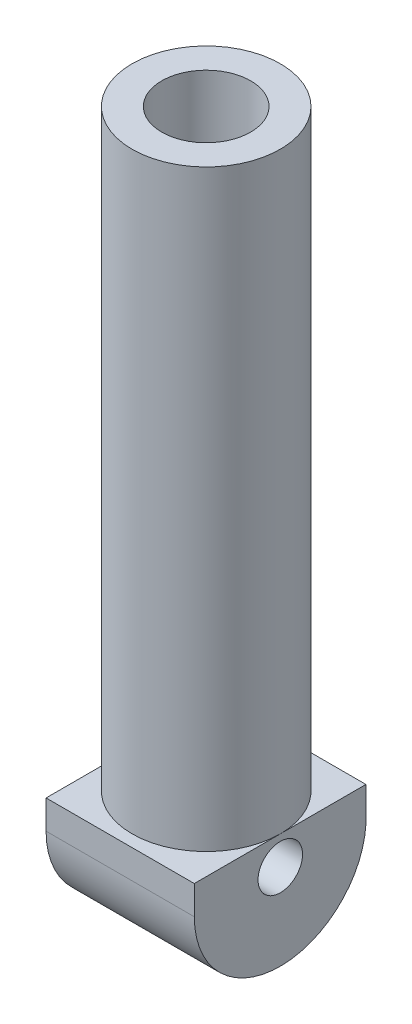
ISO-10303-21;
HEADER;
FILE_DESCRIPTION(('STEP AP214'),'2;1');
FILE_NAME('part.step','',(''),(''),'','','');
FILE_SCHEMA(('AUTOMOTIVE_DESIGN { 1 0 10303 214 1 1 1 1 }'));
ENDSEC;
DATA;
#1=APPLICATION_CONTEXT('core data for automotive mechanical design processes');
#2=APPLICATION_PROTOCOL_DEFINITION('international standard','automotive_design',2000,#1);
#3=PRODUCT_CONTEXT('',#1,'mechanical');
#4=PRODUCT('Part','Part','',(#3));
#5=PRODUCT_RELATED_PRODUCT_CATEGORY('part','',(#4));
#6=PRODUCT_DEFINITION_FORMATION('','',#4);
#7=PRODUCT_DEFINITION_CONTEXT('part definition',#1,'design');
#8=PRODUCT_DEFINITION('design','',#6,#7);
#9=PRODUCT_DEFINITION_SHAPE('','',#8);
#10=(LENGTH_UNIT() NAMED_UNIT(*) SI_UNIT(.MILLI.,.METRE.));
#11=(NAMED_UNIT(*) PLANE_ANGLE_UNIT() SI_UNIT($,.RADIAN.));
#12=(NAMED_UNIT(*) SI_UNIT($,.STERADIAN.) SOLID_ANGLE_UNIT());
#13=UNCERTAINTY_MEASURE_WITH_UNIT(LENGTH_MEASURE(1.E-05),#10,'distance_accuracy_value','');
#14=(GEOMETRIC_REPRESENTATION_CONTEXT(3) GLOBAL_UNCERTAINTY_ASSIGNED_CONTEXT((#13)) GLOBAL_UNIT_ASSIGNED_CONTEXT((#10,
#11,#12)) REPRESENTATION_CONTEXT('',''));
#15=CARTESIAN_POINT('',(0.,0.,0.));
#16=DIRECTION('',(0.,0.,1.));
#17=DIRECTION('',(1.,0.,0.));
#18=AXIS2_PLACEMENT_3D('',#15,#16,#17);
#19=CARTESIAN_POINT('',(0.,200.,0.));
#20=DIRECTION('',(0.,1.,0.));
#21=DIRECTION('',(0.,0.,1.));
#22=AXIS2_PLACEMENT_3D('',#19,#20,#21);
#23=PLANE('',#22);
#24=CARTESIAN_POINT('',(0.,200.,0.));
#25=DIRECTION('',(0.,1.,0.));
#26=DIRECTION('',(0.,0.,1.));
#27=AXIS2_PLACEMENT_3D('',#24,#25,#26);
#28=CIRCLE('',#27,25.);
#29=CARTESIAN_POINT('',(0.,200.,25.));
#30=VERTEX_POINT('',#29);
#31=EDGE_CURVE('E11',#30,#30,#28,.T.);
#32=ORIENTED_EDGE('',*,*,#31,.T.);
#33=EDGE_LOOP('',(#32));
#34=FACE_BOUND('',#33,.T.);
#35=CARTESIAN_POINT('',(0.,200.,0.));
#36=DIRECTION('',(0.,1.,0.));
#37=DIRECTION('',(0.,0.,1.));
#38=AXIS2_PLACEMENT_3D('',#35,#36,#37);
#39=CIRCLE('',#38,15.);
#40=CARTESIAN_POINT('',(0.,200.,15.));
#41=VERTEX_POINT('',#40);
#42=EDGE_CURVE('E119',#41,#41,#39,.T.);
#43=ORIENTED_EDGE('',*,*,#42,.F.);
#44=EDGE_LOOP('',(#43));
#45=FACE_BOUND('',#44,.T.);
#46=ADVANCED_FACE('F38',(#34,#45),#23,.T.);
#47=CARTESIAN_POINT('',(0.,200.,0.));
#48=DIRECTION('',(0.,-1.,0.));
#49=DIRECTION('',(0.,0.,-1.));
#50=AXIS2_PLACEMENT_3D('',#47,#48,#49);
#51=CYLINDRICAL_SURFACE('',#50,25.);
#52=ORIENTED_EDGE('',*,*,#31,.F.);
#53=EDGE_LOOP('',(#52));
#54=FACE_BOUND('',#53,.T.);
#55=CARTESIAN_POINT('',(0.,0.,0.));
#56=DIRECTION('',(0.,1.,0.));
#57=DIRECTION('',(0.,0.,1.));
#58=AXIS2_PLACEMENT_3D('',#55,#56,#57);
#59=CIRCLE('',#58,25.);
#60=CARTESIAN_POINT('',(25.,0.,0.));
#61=VERTEX_POINT('',#60);
#62=CARTESIAN_POINT('',(-25.,0.,0.));
#63=VERTEX_POINT('',#62);
#64=EDGE_CURVE('E42',#61,#63,#59,.T.);
#65=ORIENTED_EDGE('',*,*,#64,.T.);
#66=EDGE_CURVE('E59',#63,#61,#59,.T.);
#67=ORIENTED_EDGE('',*,*,#66,.T.);
#68=EDGE_LOOP('',(#65,#67));
#69=FACE_BOUND('',#68,.T.);
#70=ADVANCED_FACE('F40',(#54,#69),#51,.T.);
#71=CARTESIAN_POINT('',(0.,200.,0.));
#72=DIRECTION('',(0.,-1.,0.));
#73=DIRECTION('',(0.,0.,-1.));
#74=AXIS2_PLACEMENT_3D('',#71,#72,#73);
#75=CYLINDRICAL_SURFACE('',#74,15.);
#76=ORIENTED_EDGE('',*,*,#42,.T.);
#77=EDGE_LOOP('',(#76));
#78=FACE_BOUND('',#77,.T.);
#79=CARTESIAN_POINT('',(0.,0.,0.));
#80=DIRECTION('',(0.,1.,0.));
#81=DIRECTION('',(0.,0.,1.));
#82=AXIS2_PLACEMENT_3D('',#79,#80,#81);
#83=CIRCLE('',#82,15.);
#84=CARTESIAN_POINT('',(0.,0.,15.));
#85=VERTEX_POINT('',#84);
#86=EDGE_CURVE('E114',#85,#85,#83,.T.);
#87=ORIENTED_EDGE('',*,*,#86,.F.);
#88=EDGE_LOOP('',(#87));
#89=FACE_BOUND('',#88,.T.);
#90=ADVANCED_FACE('F133',(#78,#89),#75,.F.);
#91=CARTESIAN_POINT('',(-25.,0.,-28.883907525267));
#92=DIRECTION('',(0.,-1.,0.));
#93=DIRECTION('',(0.,0.,-1.));
#94=AXIS2_PLACEMENT_3D('',#91,#92,#93);
#95=PLANE('',#94);
#96=ORIENTED_EDGE('',*,*,#86,.T.);
#97=EDGE_LOOP('',(#96));
#98=FACE_BOUND('',#97,.T.);
#99=ADVANCED_FACE('F139',(#98),#95,.F.);
#100=ORIENTED_EDGE('',*,*,#64,.F.);
#101=DIRECTION('',(0.,0.,-1.));
#102=VECTOR('',#101,1.);
#103=CARTESIAN_POINT('',(25.,0.,-28.883907525267));
#104=LINE('',#103,#102);
#105=CARTESIAN_POINT('',(25.,0.,-28.883907525267));
#106=VERTEX_POINT('',#105);
#107=EDGE_CURVE('E111',#61,#106,#104,.T.);
#108=ORIENTED_EDGE('',*,*,#107,.T.);
#109=DIRECTION('',(1.,0.,0.));
#110=VECTOR('',#109,1.);
#111=CARTESIAN_POINT('',(-25.,0.,-28.883907525267));
#112=LINE('',#111,#110);
#113=CARTESIAN_POINT('',(-25.,0.,-28.883907525267));
#114=VERTEX_POINT('',#113);
#115=EDGE_CURVE('E103',#114,#106,#112,.T.);
#116=ORIENTED_EDGE('',*,*,#115,.F.);
#117=DIRECTION('',(0.,0.,-1.));
#118=VECTOR('',#117,1.);
#119=CARTESIAN_POINT('',(-25.,0.,-28.883907525267));
#120=LINE('',#119,#118);
#121=EDGE_CURVE('E86',#63,#114,#120,.T.);
#122=ORIENTED_EDGE('',*,*,#121,.F.);
#123=EDGE_LOOP('',(#100,#108,#116,#122));
#124=FACE_BOUND('',#123,.T.);
#125=ADVANCED_FACE('F110',(#124),#95,.F.);
#126=CARTESIAN_POINT('',(-25.,-9.70617467886981,0.0321825998316344));
#127=DIRECTION('',(1.,0.,0.));
#128=DIRECTION('',(0.,0.,-1.));
#129=AXIS2_PLACEMENT_3D('',#126,#127,#128);
#130=PLANE('',#129);
#131=CARTESIAN_POINT('',(-25.,0.,29.012112285598));
#132=VERTEX_POINT('',#131);
#133=EDGE_CURVE('E92',#132,#63,#120,.T.);
#134=ORIENTED_EDGE('',*,*,#133,.T.);
#135=ORIENTED_EDGE('',*,*,#121,.T.);
#136=DIRECTION('',(0.,-1.,0.));
#137=VECTOR('',#136,1.);
#138=CARTESIAN_POINT('',(-25.,-11.6286877397183,-28.883907525267));
#139=LINE('',#138,#137);
#140=CARTESIAN_POINT('',(-25.,-11.6286877397183,-28.883907525267));
#141=VERTEX_POINT('',#140);
#142=EDGE_CURVE('E90',#114,#141,#139,.T.);
#143=ORIENTED_EDGE('',*,*,#142,.T.);
#144=CARTESIAN_POINT('',(-25.,-9.70617467886981,0.0321825998316344));
#145=DIRECTION('',(-1.,0.,0.));
#146=DIRECTION('',(0.,0.,-1.));
#147=AXIS2_PLACEMENT_3D('',#144,#145,#146);
#148=CIRCLE('',#147,28.9799296857663);
#149=CARTESIAN_POINT('',(-25.,-9.70617467886981,29.012112285598));
#150=VERTEX_POINT('',#149);
#151=EDGE_CURVE('E108',#141,#150,#148,.T.);
#152=ORIENTED_EDGE('',*,*,#151,.T.);
#153=DIRECTION('',(0.,1.,0.));
#154=VECTOR('',#153,1.);
#155=CARTESIAN_POINT('',(-25.,0.,29.012112285598));
#156=LINE('',#155,#154);
#157=EDGE_CURVE('E187',#150,#132,#156,.T.);
#158=ORIENTED_EDGE('',*,*,#157,.T.);
#159=EDGE_LOOP('',(#134,#135,#143,#152,#158));
#160=FACE_BOUND('',#159,.T.);
#161=CARTESIAN_POINT('',(-25.,-9.70617467886981,0.));
#162=DIRECTION('',(-1.,0.,0.));
#163=DIRECTION('',(0.,0.,1.));
#164=AXIS2_PLACEMENT_3D('',#161,#162,#163);
#165=CIRCLE('',#164,7.5);
#166=CARTESIAN_POINT('',(-25.,-9.70617467886981,7.5));
#167=VERTEX_POINT('',#166);
#168=EDGE_CURVE('E174',#167,#167,#165,.T.);
#169=ORIENTED_EDGE('',*,*,#168,.F.);
#170=EDGE_LOOP('',(#169));
#171=FACE_BOUND('',#170,.T.);
#172=ADVANCED_FACE('F88',(#160,#171),#130,.F.);
#173=CARTESIAN_POINT('',(25.,-9.70617467886981,0.0321825998316344));
#174=DIRECTION('',(1.,0.,0.));
#175=DIRECTION('',(0.,0.,-1.));
#176=AXIS2_PLACEMENT_3D('',#173,#174,#175);
#177=PLANE('',#176);
#178=CARTESIAN_POINT('',(25.,0.,29.012112285598));
#179=VERTEX_POINT('',#178);
#180=EDGE_CURVE('E54',#179,#61,#104,.T.);
#181=ORIENTED_EDGE('',*,*,#180,.F.);
#182=DIRECTION('',(0.,1.,0.));
#183=VECTOR('',#182,1.);
#184=CARTESIAN_POINT('',(25.,0.,29.012112285598));
#185=LINE('',#184,#183);
#186=CARTESIAN_POINT('',(25.,-9.70617467886981,29.012112285598));
#187=VERTEX_POINT('',#186);
#188=EDGE_CURVE('E98',#187,#179,#185,.T.);
#189=ORIENTED_EDGE('',*,*,#188,.F.);
#190=CARTESIAN_POINT('',(25.,-9.70617467886981,0.0321825998316344));
#191=DIRECTION('',(-1.,0.,0.));
#192=DIRECTION('',(0.,0.,-1.));
#193=AXIS2_PLACEMENT_3D('',#190,#191,#192);
#194=CIRCLE('',#193,28.9799296857663);
#195=CARTESIAN_POINT('',(25.,-11.6286877397183,-28.883907525267));
#196=VERTEX_POINT('',#195);
#197=EDGE_CURVE('E196',#196,#187,#194,.T.);
#198=ORIENTED_EDGE('',*,*,#197,.F.);
#199=DIRECTION('',(0.,-1.,0.));
#200=VECTOR('',#199,1.);
#201=CARTESIAN_POINT('',(25.,-11.6286877397183,-28.883907525267));
#202=LINE('',#201,#200);
#203=EDGE_CURVE('E193',#106,#196,#202,.T.);
#204=ORIENTED_EDGE('',*,*,#203,.F.);
#205=ORIENTED_EDGE('',*,*,#107,.F.);
#206=EDGE_LOOP('',(#181,#189,#198,#204,#205));
#207=FACE_BOUND('',#206,.T.);
#208=CARTESIAN_POINT('',(25.,-9.70617467886981,0.));
#209=DIRECTION('',(-1.,0.,0.));
#210=DIRECTION('',(0.,0.,1.));
#211=AXIS2_PLACEMENT_3D('',#208,#209,#210);
#212=CIRCLE('',#211,7.5);
#213=CARTESIAN_POINT('',(25.,-9.70617467886981,7.5));
#214=VERTEX_POINT('',#213);
#215=EDGE_CURVE('E177',#214,#214,#212,.T.);
#216=ORIENTED_EDGE('',*,*,#215,.T.);
#217=EDGE_LOOP('',(#216));
#218=FACE_BOUND('',#217,.T.);
#219=ADVANCED_FACE('F150',(#207,#218),#177,.T.);
#220=ORIENTED_EDGE('',*,*,#66,.F.);
#221=ORIENTED_EDGE('',*,*,#133,.F.);
#222=DIRECTION('',(1.,0.,0.));
#223=VECTOR('',#222,1.);
#224=CARTESIAN_POINT('',(-25.,0.,29.012112285598));
#225=LINE('',#224,#223);
#226=EDGE_CURVE('E190',#132,#179,#225,.T.);
#227=ORIENTED_EDGE('',*,*,#226,.T.);
#228=ORIENTED_EDGE('',*,*,#180,.T.);
#229=EDGE_LOOP('',(#220,#221,#227,#228));
#230=FACE_BOUND('',#229,.T.);
#231=ADVANCED_FACE('F147',(#230),#95,.F.);
#232=CARTESIAN_POINT('',(-25.,-11.6286877397183,-28.883907525267));
#233=DIRECTION('',(0.,0.,1.));
#234=DIRECTION('',(1.,0.,0.));
#235=AXIS2_PLACEMENT_3D('',#232,#233,#234);
#236=PLANE('',#235);
#237=ORIENTED_EDGE('',*,*,#203,.T.);
#238=DIRECTION('',(1.,0.,0.));
#239=VECTOR('',#238,1.);
#240=CARTESIAN_POINT('',(-25.,-11.6286877397183,-28.883907525267));
#241=LINE('',#240,#239);
#242=EDGE_CURVE('E105',#141,#196,#241,.T.);
#243=ORIENTED_EDGE('',*,*,#242,.F.);
#244=ORIENTED_EDGE('',*,*,#142,.F.);
#245=ORIENTED_EDGE('',*,*,#115,.T.);
#246=EDGE_LOOP('',(#237,#243,#244,#245));
#247=FACE_BOUND('',#246,.T.);
#248=ADVANCED_FACE('F102',(#247),#236,.F.);
#249=CARTESIAN_POINT('',(-25.,-9.70617467886981,0.0321825998316344));
#250=DIRECTION('',(1.,0.,0.));
#251=DIRECTION('',(0.,0.,-1.));
#252=AXIS2_PLACEMENT_3D('',#249,#250,#251);
#253=CYLINDRICAL_SURFACE('',#252,28.9799296857663);
#254=ORIENTED_EDGE('',*,*,#197,.T.);
#255=DIRECTION('',(1.,0.,0.));
#256=VECTOR('',#255,1.);
#257=CARTESIAN_POINT('',(-25.,-9.70617467886981,29.012112285598));
#258=LINE('',#257,#256);
#259=EDGE_CURVE('E121',#150,#187,#258,.T.);
#260=ORIENTED_EDGE('',*,*,#259,.F.);
#261=ORIENTED_EDGE('',*,*,#151,.F.);
#262=ORIENTED_EDGE('',*,*,#242,.T.);
#263=EDGE_LOOP('',(#254,#260,#261,#262));
#264=FACE_BOUND('',#263,.T.);
#265=ADVANCED_FACE('F153',(#264),#253,.T.);
#266=CARTESIAN_POINT('',(-25.,0.,29.012112285598));
#267=DIRECTION('',(0.,0.,-1.));
#268=DIRECTION('',(-1.,0.,0.));
#269=AXIS2_PLACEMENT_3D('',#266,#267,#268);
#270=PLANE('',#269);
#271=ORIENTED_EDGE('',*,*,#188,.T.);
#272=ORIENTED_EDGE('',*,*,#226,.F.);
#273=ORIENTED_EDGE('',*,*,#157,.F.);
#274=ORIENTED_EDGE('',*,*,#259,.T.);
#275=EDGE_LOOP('',(#271,#272,#273,#274));
#276=FACE_BOUND('',#275,.T.);
#277=ADVANCED_FACE('F156',(#276),#270,.F.);
#278=CARTESIAN_POINT('',(-25.,-9.70617467886981,0.));
#279=DIRECTION('',(1.,0.,0.));
#280=DIRECTION('',(0.,0.,-1.));
#281=AXIS2_PLACEMENT_3D('',#278,#279,#280);
#282=CYLINDRICAL_SURFACE('',#281,7.5);
#283=ORIENTED_EDGE('',*,*,#168,.T.);
#284=EDGE_LOOP('',(#283));
#285=FACE_BOUND('',#284,.T.);
#286=ORIENTED_EDGE('',*,*,#215,.F.);
#287=EDGE_LOOP('',(#286));
#288=FACE_BOUND('',#287,.T.);
#289=ADVANCED_FACE('F160',(#285,#288),#282,.F.);
#290=CLOSED_SHELL('',(#46,#70,#90,#99,#125,#172,#219,#231,#248,#265,#277,#289));
#291=MANIFOLD_SOLID_BREP('B2',#290);
#292=ADVANCED_BREP_SHAPE_REPRESENTATION('',(#18,#291),#14);
#293=SHAPE_DEFINITION_REPRESENTATION(#9,#292);
ENDSEC;
END-ISO-10303-21;
